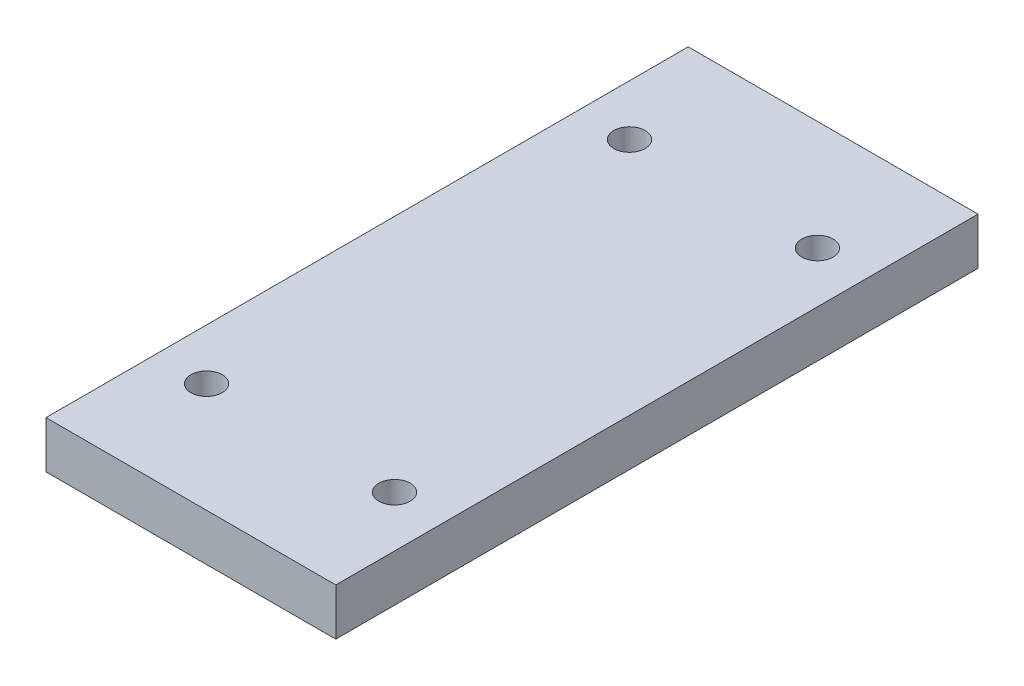
ISO-10303-21;
HEADER;
FILE_DESCRIPTION(('STEP AP214'),'2;1');
FILE_NAME('part.step','',(''),(''),'','','');
FILE_SCHEMA(('AUTOMOTIVE_DESIGN { 1 0 10303 214 1 1 1 1 }'));
ENDSEC;
DATA;
#1=APPLICATION_CONTEXT('core data for automotive mechanical design processes');
#2=APPLICATION_PROTOCOL_DEFINITION('international standard','automotive_design',2000,#1);
#3=PRODUCT_CONTEXT('',#1,'mechanical');
#4=PRODUCT('Part','Part','',(#3));
#5=PRODUCT_RELATED_PRODUCT_CATEGORY('part','',(#4));
#6=PRODUCT_DEFINITION_FORMATION('','',#4);
#7=PRODUCT_DEFINITION_CONTEXT('part definition',#1,'design');
#8=PRODUCT_DEFINITION('design','',#6,#7);
#9=PRODUCT_DEFINITION_SHAPE('','',#8);
#10=(LENGTH_UNIT() NAMED_UNIT(*) SI_UNIT(.MILLI.,.METRE.));
#11=(NAMED_UNIT(*) PLANE_ANGLE_UNIT() SI_UNIT($,.RADIAN.));
#12=(NAMED_UNIT(*) SI_UNIT($,.STERADIAN.) SOLID_ANGLE_UNIT());
#13=UNCERTAINTY_MEASURE_WITH_UNIT(LENGTH_MEASURE(1.E-05),#10,'distance_accuracy_value','');
#14=(GEOMETRIC_REPRESENTATION_CONTEXT(3) GLOBAL_UNCERTAINTY_ASSIGNED_CONTEXT((#13)) GLOBAL_UNIT_ASSIGNED_CONTEXT((#10,
#11,#12)) REPRESENTATION_CONTEXT('',''));
#15=CARTESIAN_POINT('',(0.,0.,0.));
#16=DIRECTION('',(0.,0.,1.));
#17=DIRECTION('',(1.,0.,0.));
#18=AXIS2_PLACEMENT_3D('',#15,#16,#17);
#19=CARTESIAN_POINT('',(0.,3.,0.));
#20=DIRECTION('',(0.,1.,0.));
#21=DIRECTION('',(0.,0.,1.));
#22=AXIS2_PLACEMENT_3D('',#19,#20,#21);
#23=PLANE('',#22);
#24=CARTESIAN_POINT('',(-3.0040136119467,3.,14.0617235156014));
#25=DIRECTION('',(0.,1.,0.));
#26=DIRECTION('',(0.,0.,1.));
#27=AXIS2_PLACEMENT_3D('',#24,#25,#26);
#28=CIRCLE('',#27,0.999767819676095);
#29=CARTESIAN_POINT('',(-3.0040136119467,3.,15.0614913352775));
#30=VERTEX_POINT('',#29);
#31=EDGE_CURVE('E142',#30,#30,#28,.T.);
#32=ORIENTED_EDGE('',*,*,#31,.F.);
#33=EDGE_LOOP('',(#32));
#34=FACE_BOUND('',#33,.T.);
#35=CARTESIAN_POINT('',(-3.00440538788759,3.,-12.9383259939251));
#36=DIRECTION('',(0.,1.,0.));
#37=DIRECTION('',(0.,0.,1.));
#38=AXIS2_PLACEMENT_3D('',#35,#36,#37);
#39=CIRCLE('',#38,0.99999987799438);
#40=CARTESIAN_POINT('',(-3.00440538788759,3.,-11.9383261159307));
#41=VERTEX_POINT('',#40);
#42=EDGE_CURVE('E112',#41,#41,#39,.T.);
#43=ORIENTED_EDGE('',*,*,#42,.F.);
#44=EDGE_LOOP('',(#43));
#45=FACE_BOUND('',#44,.T.);
#46=DIRECTION('',(-1.,0.,0.));
#47=VECTOR('',#46,1.);
#48=CARTESIAN_POINT('',(12.2455945546933,3.,-19.938326020995));
#49=LINE('',#48,#47);
#50=CARTESIAN_POINT('',(12.2455945546933,3.,-19.938326020995));
#51=VERTEX_POINT('',#50);
#52=CARTESIAN_POINT('',(-6.25440544530666,3.,-19.938326020995));
#53=VERTEX_POINT('',#52);
#54=EDGE_CURVE('E92',#51,#53,#49,.T.);
#55=ORIENTED_EDGE('',*,*,#54,.T.);
#56=DIRECTION('',(0.,0.,1.));
#57=VECTOR('',#56,1.);
#58=CARTESIAN_POINT('',(-6.25440544530666,3.,-19.938326020995));
#59=LINE('',#58,#57);
#60=CARTESIAN_POINT('',(-6.25440544530666,3.,21.061673979005));
#61=VERTEX_POINT('',#60);
#62=EDGE_CURVE('E87',#53,#61,#59,.T.);
#63=ORIENTED_EDGE('',*,*,#62,.T.);
#64=DIRECTION('',(1.,0.,0.));
#65=VECTOR('',#64,1.);
#66=CARTESIAN_POINT('',(-6.25440544530666,3.,21.061673979005));
#67=LINE('',#66,#65);
#68=CARTESIAN_POINT('',(12.2455945546933,3.,21.061673979005));
#69=VERTEX_POINT('',#68);
#70=EDGE_CURVE('E90',#61,#69,#67,.T.);
#71=ORIENTED_EDGE('',*,*,#70,.T.);
#72=DIRECTION('',(0.,0.,-1.));
#73=VECTOR('',#72,1.);
#74=CARTESIAN_POINT('',(12.2455945546933,3.,21.061673979005));
#75=LINE('',#74,#73);
#76=EDGE_CURVE('E57',#69,#51,#75,.T.);
#77=ORIENTED_EDGE('',*,*,#76,.T.);
#78=EDGE_LOOP('',(#55,#63,#71,#77));
#79=FACE_BOUND('',#78,.T.);
#80=CARTESIAN_POINT('',(8.99559464503335,3.,-12.9383258122313));
#81=DIRECTION('',(0.,1.,0.));
#82=DIRECTION('',(0.,0.,1.));
#83=AXIS2_PLACEMENT_3D('',#80,#81,#82);
#84=CIRCLE('',#83,1.0000000379531);
#85=CARTESIAN_POINT('',(8.99559464503335,3.,-11.9383257742782));
#86=VERTEX_POINT('',#85);
#87=EDGE_CURVE('E134',#86,#86,#84,.T.);
#88=ORIENTED_EDGE('',*,*,#87,.F.);
#89=EDGE_LOOP('',(#88));
#90=FACE_BOUND('',#89,.T.);
#91=CARTESIAN_POINT('',(8.99559459959174,3.,14.0616741389904));
#92=DIRECTION('',(0.,1.,0.));
#93=DIRECTION('',(0.,0.,1.));
#94=AXIS2_PLACEMENT_3D('',#91,#92,#93);
#95=CIRCLE('',#94,0.999999972231703);
#96=CARTESIAN_POINT('',(8.99559459959174,3.,15.0616741112221));
#97=VERTEX_POINT('',#96);
#98=EDGE_CURVE('E150',#97,#97,#95,.T.);
#99=ORIENTED_EDGE('',*,*,#98,.F.);
#100=EDGE_LOOP('',(#99));
#101=FACE_BOUND('',#100,.T.);
#102=ADVANCED_FACE('F39',(#34,#45,#79,#90,#101),#23,.T.);
#103=CARTESIAN_POINT('',(0.,0.,0.));
#104=DIRECTION('',(0.,1.,0.));
#105=DIRECTION('',(0.,0.,1.));
#106=AXIS2_PLACEMENT_3D('',#103,#104,#105);
#107=PLANE('',#106);
#108=DIRECTION('',(-1.,0.,0.));
#109=VECTOR('',#108,1.);
#110=CARTESIAN_POINT('',(12.2455945546933,0.,-19.938326020995));
#111=LINE('',#110,#109);
#112=CARTESIAN_POINT('',(12.2455945546933,0.,-19.938326020995));
#113=VERTEX_POINT('',#112);
#114=CARTESIAN_POINT('',(-6.25440544530666,0.,-19.938326020995));
#115=VERTEX_POINT('',#114);
#116=EDGE_CURVE('E108',#113,#115,#111,.T.);
#117=ORIENTED_EDGE('',*,*,#116,.F.);
#118=DIRECTION('',(0.,0.,-1.));
#119=VECTOR('',#118,1.);
#120=CARTESIAN_POINT('',(12.2455945546933,0.,21.061673979005));
#121=LINE('',#120,#119);
#122=CARTESIAN_POINT('',(12.2455945546933,0.,21.061673979005));
#123=VERTEX_POINT('',#122);
#124=EDGE_CURVE('E80',#123,#113,#121,.T.);
#125=ORIENTED_EDGE('',*,*,#124,.F.);
#126=DIRECTION('',(1.,0.,0.));
#127=VECTOR('',#126,1.);
#128=CARTESIAN_POINT('',(-6.25440544530666,0.,21.061673979005));
#129=LINE('',#128,#127);
#130=CARTESIAN_POINT('',(-6.25440544530666,0.,21.061673979005));
#131=VERTEX_POINT('',#130);
#132=EDGE_CURVE('E74',#131,#123,#129,.T.);
#133=ORIENTED_EDGE('',*,*,#132,.F.);
#134=DIRECTION('',(0.,0.,1.));
#135=VECTOR('',#134,1.);
#136=CARTESIAN_POINT('',(-6.25440544530666,0.,-19.938326020995));
#137=LINE('',#136,#135);
#138=EDGE_CURVE('E97',#115,#131,#137,.T.);
#139=ORIENTED_EDGE('',*,*,#138,.F.);
#140=EDGE_LOOP('',(#117,#125,#133,#139));
#141=FACE_BOUND('',#140,.T.);
#142=CARTESIAN_POINT('',(-3.00440538788759,0.,-12.9383259939251));
#143=DIRECTION('',(0.,1.,0.));
#144=DIRECTION('',(0.,0.,1.));
#145=AXIS2_PLACEMENT_3D('',#142,#143,#144);
#146=CIRCLE('',#145,0.99999987799438);
#147=CARTESIAN_POINT('',(-3.00440538788759,0.,-11.9383261159307));
#148=VERTEX_POINT('',#147);
#149=EDGE_CURVE('E130',#148,#148,#146,.T.);
#150=ORIENTED_EDGE('',*,*,#149,.T.);
#151=EDGE_LOOP('',(#150));
#152=FACE_BOUND('',#151,.T.);
#153=CARTESIAN_POINT('',(8.99559464503335,0.,-12.9383258122313));
#154=DIRECTION('',(0.,1.,0.));
#155=DIRECTION('',(0.,0.,1.));
#156=AXIS2_PLACEMENT_3D('',#153,#154,#155);
#157=CIRCLE('',#156,1.0000000379531);
#158=CARTESIAN_POINT('',(8.99559464503335,0.,-11.9383257742782));
#159=VERTEX_POINT('',#158);
#160=EDGE_CURVE('E138',#159,#159,#157,.T.);
#161=ORIENTED_EDGE('',*,*,#160,.T.);
#162=EDGE_LOOP('',(#161));
#163=FACE_BOUND('',#162,.T.);
#164=CARTESIAN_POINT('',(-3.0040136119467,0.,14.0617235156014));
#165=DIRECTION('',(0.,1.,0.));
#166=DIRECTION('',(0.,0.,1.));
#167=AXIS2_PLACEMENT_3D('',#164,#165,#166);
#168=CIRCLE('',#167,0.999767819676095);
#169=CARTESIAN_POINT('',(-3.0040136119467,0.,15.0614913352775));
#170=VERTEX_POINT('',#169);
#171=EDGE_CURVE('E146',#170,#170,#168,.T.);
#172=ORIENTED_EDGE('',*,*,#171,.T.);
#173=EDGE_LOOP('',(#172));
#174=FACE_BOUND('',#173,.T.);
#175=CARTESIAN_POINT('',(8.99559459959174,0.,14.0616741389904));
#176=DIRECTION('',(0.,1.,0.));
#177=DIRECTION('',(0.,0.,1.));
#178=AXIS2_PLACEMENT_3D('',#175,#176,#177);
#179=CIRCLE('',#178,0.999999972231703);
#180=CARTESIAN_POINT('',(8.99559459959174,0.,15.0616741112221));
#181=VERTEX_POINT('',#180);
#182=EDGE_CURVE('E154',#181,#181,#179,.T.);
#183=ORIENTED_EDGE('',*,*,#182,.T.);
#184=EDGE_LOOP('',(#183));
#185=FACE_BOUND('',#184,.T.);
#186=ADVANCED_FACE('F125',(#141,#152,#163,#174,#185),#107,.F.);
#187=CARTESIAN_POINT('',(12.2455945546933,3.,-19.938326020995));
#188=DIRECTION('',(0.,0.,1.));
#189=DIRECTION('',(1.,0.,0.));
#190=AXIS2_PLACEMENT_3D('',#187,#188,#189);
#191=PLANE('',#190);
#192=ORIENTED_EDGE('',*,*,#116,.T.);
#193=DIRECTION('',(0.,-1.,0.));
#194=VECTOR('',#193,1.);
#195=CARTESIAN_POINT('',(-6.25440544530666,3.,-19.938326020995));
#196=LINE('',#195,#194);
#197=EDGE_CURVE('E11',#53,#115,#196,.T.);
#198=ORIENTED_EDGE('',*,*,#197,.F.);
#199=ORIENTED_EDGE('',*,*,#54,.F.);
#200=DIRECTION('',(0.,-1.,0.));
#201=VECTOR('',#200,1.);
#202=CARTESIAN_POINT('',(12.2455945546933,3.,-19.938326020995));
#203=LINE('',#202,#201);
#204=EDGE_CURVE('E104',#51,#113,#203,.T.);
#205=ORIENTED_EDGE('',*,*,#204,.T.);
#206=EDGE_LOOP('',(#192,#198,#199,#205));
#207=FACE_BOUND('',#206,.T.);
#208=ADVANCED_FACE('F41',(#207),#191,.F.);
#209=CARTESIAN_POINT('',(-6.25440544530666,3.,-19.938326020995));
#210=DIRECTION('',(1.,0.,0.));
#211=DIRECTION('',(0.,0.,-1.));
#212=AXIS2_PLACEMENT_3D('',#209,#210,#211);
#213=PLANE('',#212);
#214=ORIENTED_EDGE('',*,*,#138,.T.);
#215=DIRECTION('',(0.,-1.,0.));
#216=VECTOR('',#215,1.);
#217=CARTESIAN_POINT('',(-6.25440544530666,3.,21.061673979005));
#218=LINE('',#217,#216);
#219=EDGE_CURVE('E49',#61,#131,#218,.T.);
#220=ORIENTED_EDGE('',*,*,#219,.F.);
#221=ORIENTED_EDGE('',*,*,#62,.F.);
#222=ORIENTED_EDGE('',*,*,#197,.T.);
#223=EDGE_LOOP('',(#214,#220,#221,#222));
#224=FACE_BOUND('',#223,.T.);
#225=ADVANCED_FACE('F96',(#224),#213,.F.);
#226=CARTESIAN_POINT('',(-6.25440544530666,3.,21.061673979005));
#227=DIRECTION('',(0.,0.,-1.));
#228=DIRECTION('',(-1.,0.,0.));
#229=AXIS2_PLACEMENT_3D('',#226,#227,#228);
#230=PLANE('',#229);
#231=ORIENTED_EDGE('',*,*,#132,.T.);
#232=DIRECTION('',(0.,-1.,0.));
#233=VECTOR('',#232,1.);
#234=CARTESIAN_POINT('',(12.2455945546933,3.,21.061673979005));
#235=LINE('',#234,#233);
#236=EDGE_CURVE('E99',#69,#123,#235,.T.);
#237=ORIENTED_EDGE('',*,*,#236,.F.);
#238=ORIENTED_EDGE('',*,*,#70,.F.);
#239=ORIENTED_EDGE('',*,*,#219,.T.);
#240=EDGE_LOOP('',(#231,#237,#238,#239));
#241=FACE_BOUND('',#240,.T.);
#242=ADVANCED_FACE('F100',(#241),#230,.F.);
#243=CARTESIAN_POINT('',(12.2455945546933,3.,21.061673979005));
#244=DIRECTION('',(-1.,0.,0.));
#245=DIRECTION('',(0.,0.,1.));
#246=AXIS2_PLACEMENT_3D('',#243,#244,#245);
#247=PLANE('',#246);
#248=ORIENTED_EDGE('',*,*,#124,.T.);
#249=ORIENTED_EDGE('',*,*,#204,.F.);
#250=ORIENTED_EDGE('',*,*,#76,.F.);
#251=ORIENTED_EDGE('',*,*,#236,.T.);
#252=EDGE_LOOP('',(#248,#249,#250,#251));
#253=FACE_BOUND('',#252,.T.);
#254=ADVANCED_FACE('F122',(#253),#247,.F.);
#255=CARTESIAN_POINT('',(-3.00440538788759,3.,-12.9383259939251));
#256=DIRECTION('',(0.,-1.,0.));
#257=DIRECTION('',(0.,0.,-1.));
#258=AXIS2_PLACEMENT_3D('',#255,#256,#257);
#259=CYLINDRICAL_SURFACE('',#258,0.99999987799438);
#260=ORIENTED_EDGE('',*,*,#42,.T.);
#261=EDGE_LOOP('',(#260));
#262=FACE_BOUND('',#261,.T.);
#263=ORIENTED_EDGE('',*,*,#149,.F.);
#264=EDGE_LOOP('',(#263));
#265=FACE_BOUND('',#264,.T.);
#266=ADVANCED_FACE('F175',(#262,#265),#259,.F.);
#267=CARTESIAN_POINT('',(8.99559464503335,3.,-12.9383258122313));
#268=DIRECTION('',(0.,-1.,0.));
#269=DIRECTION('',(0.,0.,-1.));
#270=AXIS2_PLACEMENT_3D('',#267,#268,#269);
#271=CYLINDRICAL_SURFACE('',#270,1.0000000379531);
#272=ORIENTED_EDGE('',*,*,#87,.T.);
#273=EDGE_LOOP('',(#272));
#274=FACE_BOUND('',#273,.T.);
#275=ORIENTED_EDGE('',*,*,#160,.F.);
#276=EDGE_LOOP('',(#275));
#277=FACE_BOUND('',#276,.T.);
#278=ADVANCED_FACE('F221',(#274,#277),#271,.F.);
#279=CARTESIAN_POINT('',(-3.0040136119467,3.,14.0617235156014));
#280=DIRECTION('',(0.,-1.,0.));
#281=DIRECTION('',(0.,0.,-1.));
#282=AXIS2_PLACEMENT_3D('',#279,#280,#281);
#283=CYLINDRICAL_SURFACE('',#282,0.999767819676095);
#284=ORIENTED_EDGE('',*,*,#31,.T.);
#285=EDGE_LOOP('',(#284));
#286=FACE_BOUND('',#285,.T.);
#287=ORIENTED_EDGE('',*,*,#171,.F.);
#288=EDGE_LOOP('',(#287));
#289=FACE_BOUND('',#288,.T.);
#290=ADVANCED_FACE('F229',(#286,#289),#283,.F.);
#291=CARTESIAN_POINT('',(8.99559459959174,3.,14.0616741389904));
#292=DIRECTION('',(0.,-1.,0.));
#293=DIRECTION('',(0.,0.,-1.));
#294=AXIS2_PLACEMENT_3D('',#291,#292,#293);
#295=CYLINDRICAL_SURFACE('',#294,0.999999972231703);
#296=ORIENTED_EDGE('',*,*,#98,.T.);
#297=EDGE_LOOP('',(#296));
#298=FACE_BOUND('',#297,.T.);
#299=ORIENTED_EDGE('',*,*,#182,.F.);
#300=EDGE_LOOP('',(#299));
#301=FACE_BOUND('',#300,.T.);
#302=ADVANCED_FACE('F162',(#298,#301),#295,.F.);
#303=CLOSED_SHELL('',(#102,#186,#208,#225,#242,#254,#266,#278,#290,#302));
#304=MANIFOLD_SOLID_BREP('B2',#303);
#305=ADVANCED_BREP_SHAPE_REPRESENTATION('',(#18,#304),#14);
#306=SHAPE_DEFINITION_REPRESENTATION(#9,#305);
ENDSEC;
END-ISO-10303-21;
